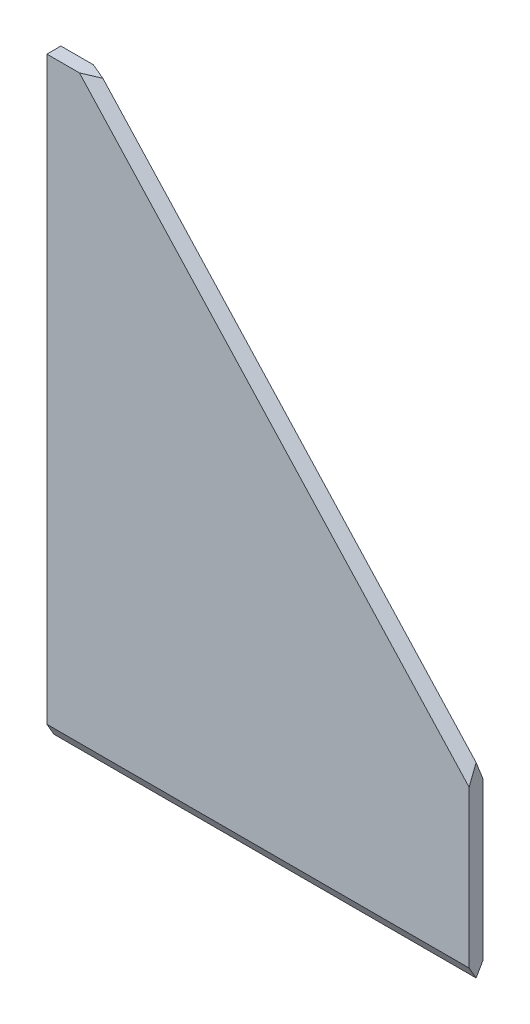
ISO-10303-21;
HEADER;
FILE_DESCRIPTION(('STEP AP214'),'2;1');
FILE_NAME('part.step','',(''),(''),'','','');
FILE_SCHEMA(('AUTOMOTIVE_DESIGN { 1 0 10303 214 1 1 1 1 }'));
ENDSEC;
DATA;
#1=APPLICATION_CONTEXT('core data for automotive mechanical design processes');
#2=APPLICATION_PROTOCOL_DEFINITION('international standard','automotive_design',2000,#1);
#3=PRODUCT_CONTEXT('',#1,'mechanical');
#4=PRODUCT('Part','Part','',(#3));
#5=PRODUCT_RELATED_PRODUCT_CATEGORY('part','',(#4));
#6=PRODUCT_DEFINITION_FORMATION('','',#4);
#7=PRODUCT_DEFINITION_CONTEXT('part definition',#1,'design');
#8=PRODUCT_DEFINITION('design','',#6,#7);
#9=PRODUCT_DEFINITION_SHAPE('','',#8);
#10=(LENGTH_UNIT() NAMED_UNIT(*) SI_UNIT(.MILLI.,.METRE.));
#11=(NAMED_UNIT(*) PLANE_ANGLE_UNIT() SI_UNIT($,.RADIAN.));
#12=(NAMED_UNIT(*) SI_UNIT($,.STERADIAN.) SOLID_ANGLE_UNIT());
#13=UNCERTAINTY_MEASURE_WITH_UNIT(LENGTH_MEASURE(1.E-05),#10,'distance_accuracy_value','');
#14=(GEOMETRIC_REPRESENTATION_CONTEXT(3) GLOBAL_UNCERTAINTY_ASSIGNED_CONTEXT((#13)) GLOBAL_UNIT_ASSIGNED_CONTEXT((#10,
#11,#12)) REPRESENTATION_CONTEXT('',''));
#15=CARTESIAN_POINT('',(0.,0.,0.));
#16=DIRECTION('',(0.,0.,1.));
#17=DIRECTION('',(1.,0.,0.));
#18=AXIS2_PLACEMENT_3D('',#15,#16,#17);
#19=CARTESIAN_POINT('',(90.5,0.,3.));
#20=DIRECTION('',(-1.,0.,0.));
#21=DIRECTION('',(0.,-1.,0.));
#22=AXIS2_PLACEMENT_3D('',#19,#20,#21);
#23=PLANE('',#22);
#24=DIRECTION('',(0.,1.,0.));
#25=VECTOR('',#24,1.);
#26=CARTESIAN_POINT('',(90.5,0.,3.));
#27=LINE('',#26,#25);
#28=CARTESIAN_POINT('',(90.5,2.59807621135333,3.));
#29=VERTEX_POINT('',#28);
#30=CARTESIAN_POINT('',(90.5,36.1616501348234,3.00000000000003));
#31=VERTEX_POINT('',#30);
#32=EDGE_CURVE('E114',#29,#31,#27,.T.);
#33=ORIENTED_EDGE('',*,*,#32,.F.);
#34=DIRECTION('',(0.,0.86602540378444,0.499999999999999));
#35=VECTOR('',#34,1.);
#36=CARTESIAN_POINT('',(90.5,0.,1.49999999999999));
#37=LINE('',#36,#35);
#38=CARTESIAN_POINT('',(90.5,0.,1.5));
#39=VERTEX_POINT('',#38);
#40=EDGE_CURVE('E136',#29,#39,#37,.F.);
#41=ORIENTED_EDGE('',*,*,#40,.T.);
#42=DIRECTION('',(0.,0.86602540378444,-0.499999999999999));
#43=VECTOR('',#42,1.);
#44=CARTESIAN_POINT('',(90.5,2.5980762113533,0.));
#45=LINE('',#44,#43);
#46=CARTESIAN_POINT('',(90.5,2.59807621135332,0.));
#47=VERTEX_POINT('',#46);
#48=EDGE_CURVE('E134',#39,#47,#45,.T.);
#49=ORIENTED_EDGE('',*,*,#48,.T.);
#50=DIRECTION('',(0.,1.,0.));
#51=VECTOR('',#50,1.);
#52=CARTESIAN_POINT('',(90.5,0.,0.));
#53=LINE('',#52,#51);
#54=CARTESIAN_POINT('',(90.5,36.1616501348234,0.));
#55=VERTEX_POINT('',#54);
#56=EDGE_CURVE('E119',#47,#55,#53,.T.);
#57=ORIENTED_EDGE('',*,*,#56,.T.);
#58=DIRECTION('',(0.,-0.931404329430846,-0.36398622929649));
#59=VECTOR('',#58,1.);
#60=CARTESIAN_POINT('',(90.5,60.3150682095763,9.43898508075776));
#61=LINE('',#60,#59);
#62=CARTESIAN_POINT('',(90.5,40.,1.5));
#63=VERTEX_POINT('',#62);
#64=EDGE_CURVE('E130',#55,#63,#61,.F.);
#65=ORIENTED_EDGE('',*,*,#64,.T.);
#66=DIRECTION('',(0.,-0.931404329430846,0.36398622929649));
#67=VECTOR('',#66,1.);
#68=CARTESIAN_POINT('',(90.5,58.2809581106565,-5.64406923005289));
#69=LINE('',#68,#67);
#70=EDGE_CURVE('E132',#63,#31,#69,.T.);
#71=ORIENTED_EDGE('',*,*,#70,.T.);
#72=EDGE_LOOP('',(#33,#41,#49,#57,#65,#71));
#73=FACE_BOUND('',#72,.T.);
#74=ADVANCED_FACE('F35',(#73),#23,.F.);
#75=CARTESIAN_POINT('',(0.,127.,3.));
#76=DIRECTION('',(0.,1.,0.));
#77=DIRECTION('',(0.,0.,1.));
#78=AXIS2_PLACEMENT_3D('',#75,#76,#77);
#79=PLANE('',#78);
#80=DIRECTION('',(1.,0.,0.));
#81=VECTOR('',#80,1.);
#82=CARTESIAN_POINT('',(0.,127.,3.));
#83=LINE('',#82,#81);
#84=CARTESIAN_POINT('',(0.,127.,3.));
#85=VERTEX_POINT('',#84);
#86=CARTESIAN_POINT('',(6.97048288259637,127.,3.));
#87=VERTEX_POINT('',#86);
#88=EDGE_CURVE('E103',#85,#87,#83,.T.);
#89=ORIENTED_EDGE('',*,*,#88,.T.);
#90=DIRECTION('',(0.920335121239462,0.,-0.391130751300821));
#91=VECTOR('',#90,1.);
#92=CARTESIAN_POINT('',(1.06636722730964,127.,5.50917425481841));
#93=LINE('',#92,#91);
#94=CARTESIAN_POINT('',(10.5,127.,1.5));
#95=VERTEX_POINT('',#94);
#96=EDGE_CURVE('E11',#87,#95,#93,.T.);
#97=ORIENTED_EDGE('',*,*,#96,.T.);
#98=DIRECTION('',(0.920335121239462,0.,0.391130751300821));
#99=VECTOR('',#98,1.);
#100=CARTESIAN_POINT('',(2.1462813295664,127.,-2.05022446097897));
#101=LINE('',#100,#99);
#102=CARTESIAN_POINT('',(6.97048288259636,127.,0.));
#103=VERTEX_POINT('',#102);
#104=EDGE_CURVE('E44',#95,#103,#101,.F.);
#105=ORIENTED_EDGE('',*,*,#104,.T.);
#106=DIRECTION('',(1.,0.,0.));
#107=VECTOR('',#106,1.);
#108=CARTESIAN_POINT('',(0.,127.,0.));
#109=LINE('',#108,#107);
#110=CARTESIAN_POINT('',(0.,127.,0.));
#111=VERTEX_POINT('',#110);
#112=EDGE_CURVE('E106',#111,#103,#109,.T.);
#113=ORIENTED_EDGE('',*,*,#112,.F.);
#114=DIRECTION('',(0.,0.,-1.));
#115=VECTOR('',#114,1.);
#116=CARTESIAN_POINT('',(0.,127.,3.));
#117=LINE('',#116,#115);
#118=EDGE_CURVE('E96',#85,#111,#117,.T.);
#119=ORIENTED_EDGE('',*,*,#118,.F.);
#120=EDGE_LOOP('',(#89,#97,#105,#113,#119));
#121=FACE_BOUND('',#120,.T.);
#122=ADVANCED_FACE('F105',(#121),#79,.T.);
#123=CARTESIAN_POINT('',(0.,0.,3.));
#124=DIRECTION('',(-1.,0.,0.));
#125=DIRECTION('',(0.,0.,1.));
#126=AXIS2_PLACEMENT_3D('',#123,#124,#125);
#127=PLANE('',#126);
#128=DIRECTION('',(0.,-0.86602540378444,0.499999999999999));
#129=VECTOR('',#128,1.);
#130=CARTESIAN_POINT('',(0.,-0.649519052838327,1.875));
#131=LINE('',#130,#129);
#132=CARTESIAN_POINT('',(0.,2.59807621135333,0.));
#133=VERTEX_POINT('',#132);
#134=CARTESIAN_POINT('',(0.,0.,1.5));
#135=VERTEX_POINT('',#134);
#136=EDGE_CURVE('E107',#133,#135,#131,.T.);
#137=ORIENTED_EDGE('',*,*,#136,.T.);
#138=DIRECTION('',(0.,-0.86602540378444,-0.499999999999999));
#139=VECTOR('',#138,1.);
#140=CARTESIAN_POINT('',(0.,0.649519052838328,1.875));
#141=LINE('',#140,#139);
#142=CARTESIAN_POINT('',(0.,2.59807621135333,3.));
#143=VERTEX_POINT('',#142);
#144=EDGE_CURVE('E98',#135,#143,#141,.F.);
#145=ORIENTED_EDGE('',*,*,#144,.T.);
#146=DIRECTION('',(0.,1.,0.));
#147=VECTOR('',#146,1.);
#148=CARTESIAN_POINT('',(0.,0.,3.));
#149=LINE('',#148,#147);
#150=EDGE_CURVE('E92',#143,#85,#149,.T.);
#151=ORIENTED_EDGE('',*,*,#150,.T.);
#152=ORIENTED_EDGE('',*,*,#118,.T.);
#153=DIRECTION('',(0.,1.,0.));
#154=VECTOR('',#153,1.);
#155=CARTESIAN_POINT('',(0.,0.,0.));
#156=LINE('',#155,#154);
#157=EDGE_CURVE('E116',#133,#111,#156,.T.);
#158=ORIENTED_EDGE('',*,*,#157,.F.);
#159=EDGE_LOOP('',(#137,#145,#151,#152,#158));
#160=FACE_BOUND('',#159,.T.);
#161=ADVANCED_FACE('F94',(#160),#127,.T.);
#162=CARTESIAN_POINT('',(0.,0.,3.));
#163=DIRECTION('',(0.,0.,1.));
#164=DIRECTION('',(1.,0.,0.));
#165=AXIS2_PLACEMENT_3D('',#162,#163,#164);
#166=PLANE('',#165);
#167=ORIENTED_EDGE('',*,*,#150,.F.);
#168=DIRECTION('',(1.,0.,0.));
#169=VECTOR('',#168,1.);
#170=CARTESIAN_POINT('',(0.,2.59807621135333,3.));
#171=LINE('',#170,#169);
#172=EDGE_CURVE('E128',#143,#29,#171,.T.);
#173=ORIENTED_EDGE('',*,*,#172,.T.);
#174=ORIENTED_EDGE('',*,*,#32,.T.);
#175=DIRECTION('',(-0.676873214431142,0.736099620693866,0.));
#176=VECTOR('',#175,1.);
#177=CARTESIAN_POINT('',(8.58755708628905,125.241431803484,3.));
#178=LINE('',#177,#176);
#179=EDGE_CURVE('E113',#31,#87,#178,.T.);
#180=ORIENTED_EDGE('',*,*,#179,.T.);
#181=ORIENTED_EDGE('',*,*,#88,.F.);
#182=EDGE_LOOP('',(#167,#173,#174,#180,#181));
#183=FACE_BOUND('',#182,.T.);
#184=ADVANCED_FACE('F110',(#183),#166,.T.);
#185=CARTESIAN_POINT('',(0.,0.,0.));
#186=DIRECTION('',(0.,0.,1.));
#187=DIRECTION('',(1.,0.,0.));
#188=AXIS2_PLACEMENT_3D('',#185,#186,#187);
#189=PLANE('',#188);
#190=ORIENTED_EDGE('',*,*,#56,.F.);
#191=DIRECTION('',(-1.,0.,0.));
#192=VECTOR('',#191,1.);
#193=CARTESIAN_POINT('',(0.,2.59807621135333,0.));
#194=LINE('',#193,#192);
#195=EDGE_CURVE('E140',#47,#133,#194,.T.);
#196=ORIENTED_EDGE('',*,*,#195,.T.);
#197=ORIENTED_EDGE('',*,*,#157,.T.);
#198=ORIENTED_EDGE('',*,*,#112,.T.);
#199=DIRECTION('',(0.676873214431142,-0.736099620693866,0.));
#200=VECTOR('',#199,1.);
#201=CARTESIAN_POINT('',(67.0541617108148,61.6589992743125,0.));
#202=LINE('',#201,#200);
#203=EDGE_CURVE('E138',#103,#55,#202,.T.);
#204=ORIENTED_EDGE('',*,*,#203,.T.);
#205=EDGE_LOOP('',(#190,#196,#197,#198,#204));
#206=FACE_BOUND('',#205,.T.);
#207=ADVANCED_FACE('F155',(#206),#189,.F.);
#208=CARTESIAN_POINT('',(0.,2.59807621135333,0.));
#209=DIRECTION('',(0.,-0.499999999999998,-0.866025403784439));
#210=DIRECTION('',(1.,0.,0.));
#211=AXIS2_PLACEMENT_3D('',#208,#209,#210);
#212=PLANE('',#211);
#213=ORIENTED_EDGE('',*,*,#195,.F.);
#214=ORIENTED_EDGE('',*,*,#48,.F.);
#215=DIRECTION('',(1.,0.,0.));
#216=VECTOR('',#215,1.);
#217=CARTESIAN_POINT('',(90.5,0.,1.5));
#218=LINE('',#217,#216);
#219=EDGE_CURVE('E122',#135,#39,#218,.T.);
#220=ORIENTED_EDGE('',*,*,#219,.F.);
#221=ORIENTED_EDGE('',*,*,#136,.F.);
#222=EDGE_LOOP('',(#213,#214,#220,#221));
#223=FACE_BOUND('',#222,.T.);
#224=ADVANCED_FACE('F161',(#223),#212,.T.);
#225=CARTESIAN_POINT('',(0.,0.,1.5));
#226=DIRECTION('',(0.,0.499999999999998,-0.866025403784439));
#227=DIRECTION('',(-1.,0.,0.));
#228=AXIS2_PLACEMENT_3D('',#225,#226,#227);
#229=PLANE('',#228);
#230=ORIENTED_EDGE('',*,*,#40,.F.);
#231=ORIENTED_EDGE('',*,*,#172,.F.);
#232=ORIENTED_EDGE('',*,*,#144,.F.);
#233=ORIENTED_EDGE('',*,*,#219,.T.);
#234=EDGE_LOOP('',(#230,#231,#232,#233));
#235=FACE_BOUND('',#234,.T.);
#236=ADVANCED_FACE('F163',(#235),#229,.F.);
#237=CARTESIAN_POINT('',(68.9666046245257,63.4175674708283,1.5));
#238=DIRECTION('',(-0.368049810346932,-0.33843660721557,0.866025403784439));
#239=DIRECTION('',(-0.676873214431142,0.736099620693866,0.));
#240=AXIS2_PLACEMENT_3D('',#237,#238,#239);
#241=PLANE('',#240);
#242=DIRECTION('',(-0.676873214431142,0.736099620693866,0.));
#243=VECTOR('',#242,1.);
#244=CARTESIAN_POINT('',(68.9666046245257,63.4175674708283,1.5));
#245=LINE('',#244,#243);
#246=EDGE_CURVE('E39',#63,#95,#245,.T.);
#247=ORIENTED_EDGE('',*,*,#246,.F.);
#248=ORIENTED_EDGE('',*,*,#64,.F.);
#249=ORIENTED_EDGE('',*,*,#203,.F.);
#250=ORIENTED_EDGE('',*,*,#104,.F.);
#251=EDGE_LOOP('',(#247,#248,#249,#250));
#252=FACE_BOUND('',#251,.T.);
#253=ADVANCED_FACE('F37',(#252),#241,.F.);
#254=CARTESIAN_POINT('',(67.0541617108148,61.6589992743125,3.));
#255=DIRECTION('',(0.368049810346932,0.33843660721557,0.866025403784439));
#256=DIRECTION('',(0.676873214431142,-0.736099620693866,0.));
#257=AXIS2_PLACEMENT_3D('',#254,#255,#256);
#258=PLANE('',#257);
#259=ORIENTED_EDGE('',*,*,#70,.F.);
#260=ORIENTED_EDGE('',*,*,#246,.T.);
#261=ORIENTED_EDGE('',*,*,#96,.F.);
#262=ORIENTED_EDGE('',*,*,#179,.F.);
#263=EDGE_LOOP('',(#259,#260,#261,#262));
#264=FACE_BOUND('',#263,.T.);
#265=ADVANCED_FACE('F149',(#264),#258,.T.);
#266=CLOSED_SHELL('',(#74,#122,#161,#184,#207,#224,#236,#253,#265));
#267=MANIFOLD_SOLID_BREP('B2',#266);
#268=ADVANCED_BREP_SHAPE_REPRESENTATION('',(#18,#267),#14);
#269=SHAPE_DEFINITION_REPRESENTATION(#9,#268);
ENDSEC;
END-ISO-10303-21;
